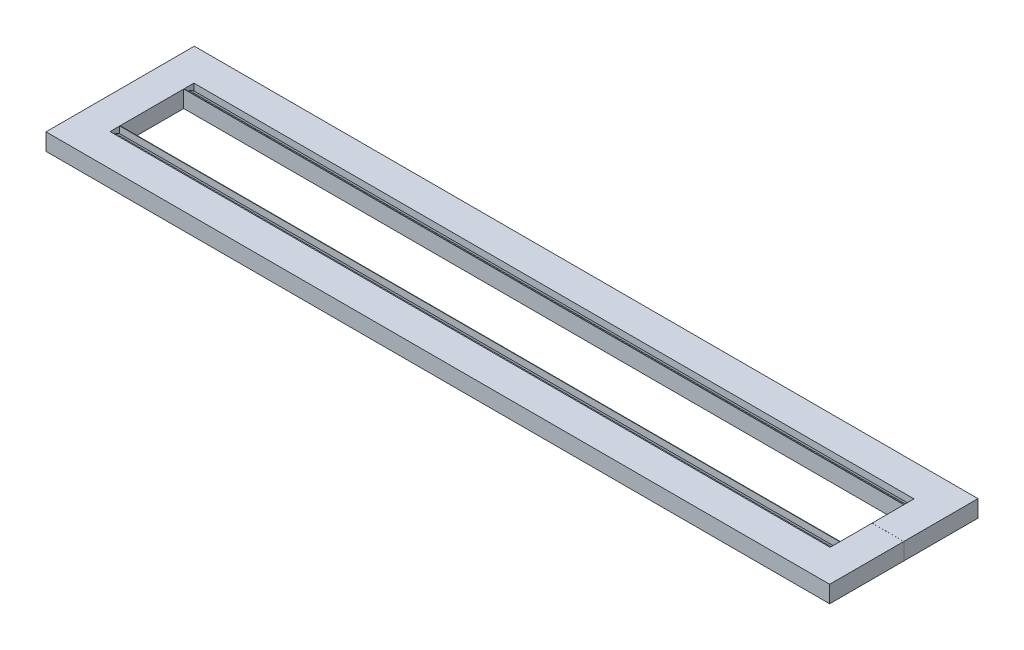
ISO-10303-21;
HEADER;
FILE_DESCRIPTION(('STEP AP214'),'2;1');
FILE_NAME('part.step','',(''),(''),'','','');
FILE_SCHEMA(('AUTOMOTIVE_DESIGN { 1 0 10303 214 1 1 1 1 }'));
ENDSEC;
DATA;
#1=APPLICATION_CONTEXT('core data for automotive mechanical design processes');
#2=APPLICATION_PROTOCOL_DEFINITION('international standard','automotive_design',2000,#1);
#3=PRODUCT_CONTEXT('',#1,'mechanical');
#4=PRODUCT('Part','Part','',(#3));
#5=PRODUCT_RELATED_PRODUCT_CATEGORY('part','',(#4));
#6=PRODUCT_DEFINITION_FORMATION('','',#4);
#7=PRODUCT_DEFINITION_CONTEXT('part definition',#1,'design');
#8=PRODUCT_DEFINITION('design','',#6,#7);
#9=PRODUCT_DEFINITION_SHAPE('','',#8);
#10=(LENGTH_UNIT() NAMED_UNIT(*) SI_UNIT(.MILLI.,.METRE.));
#11=(NAMED_UNIT(*) PLANE_ANGLE_UNIT() SI_UNIT($,.RADIAN.));
#12=(NAMED_UNIT(*) SI_UNIT($,.STERADIAN.) SOLID_ANGLE_UNIT());
#13=UNCERTAINTY_MEASURE_WITH_UNIT(LENGTH_MEASURE(1.E-05),#10,'distance_accuracy_value','');
#14=(GEOMETRIC_REPRESENTATION_CONTEXT(3) GLOBAL_UNCERTAINTY_ASSIGNED_CONTEXT((#13)) GLOBAL_UNIT_ASSIGNED_CONTEXT((#10,
#11,#12)) REPRESENTATION_CONTEXT('',''));
#15=CARTESIAN_POINT('',(0.,0.,0.));
#16=DIRECTION('',(0.,0.,1.));
#17=DIRECTION('',(1.,0.,0.));
#18=AXIS2_PLACEMENT_3D('',#15,#16,#17);
#19=CARTESIAN_POINT('',(0.,0.,0.));
#20=DIRECTION('',(0.,1.,0.));
#21=DIRECTION('',(0.,0.,1.));
#22=AXIS2_PLACEMENT_3D('',#19,#20,#21);
#23=PLANE('',#22);
#24=CARTESIAN_POINT('',(25.4039073980687,0.,-36.2480453043841));
#25=DIRECTION('',(0.,-1.,0.));
#26=DIRECTION('',(0.,0.,-1.));
#27=AXIS2_PLACEMENT_3D('',#24,#25,#26);
#28=CIRCLE('',#27,5.79119999999999);
#29=CARTESIAN_POINT('',(25.4039073980687,0.,-42.0392453043841));
#30=VERTEX_POINT('',#29);
#31=EDGE_CURVE('E593',#30,#30,#28,.T.);
#32=ORIENTED_EDGE('',*,*,#31,.F.);
#33=EDGE_LOOP('',(#32));
#34=FACE_BOUND('',#33,.T.);
#35=CARTESIAN_POINT('',(-425.156251148069,0.,10.2267903256609));
#36=DIRECTION('',(0.,-1.,0.));
#37=DIRECTION('',(0.,0.,-1.));
#38=AXIS2_PLACEMENT_3D('',#35,#36,#37);
#39=CIRCLE('',#38,5.79119999999999);
#40=CARTESIAN_POINT('',(-425.156251148069,0.,4.43559032566088));
#41=VERTEX_POINT('',#40);
#42=EDGE_CURVE('E604',#41,#41,#39,.T.);
#43=ORIENTED_EDGE('',*,*,#42,.F.);
#44=EDGE_LOOP('',(#43));
#45=FACE_BOUND('',#44,.T.);
#46=DIRECTION('',(-1.,0.,0.));
#47=VECTOR('',#46,1.);
#48=CARTESIAN_POINT('',(0.,0.,-32.0724609375));
#49=LINE('',#48,#47);
#50=CARTESIAN_POINT('',(16.0380255436917,0.,-32.0724609375));
#51=VERTEX_POINT('',#50);
#52=CARTESIAN_POINT('',(-415.776171875,0.,-32.0724609375));
#53=VERTEX_POINT('',#52);
#54=EDGE_CURVE('E347',#51,#53,#49,.T.);
#55=ORIENTED_EDGE('',*,*,#54,.T.);
#56=DIRECTION('',(0.,0.,1.));
#57=VECTOR('',#56,1.);
#58=CARTESIAN_POINT('',(-415.776171875,0.,-57.4724609374997));
#59=LINE('',#58,#57);
#60=CARTESIAN_POINT('',(-415.776171875,0.,6.074872855054));
#61=VERTEX_POINT('',#60);
#62=EDGE_CURVE('E301',#53,#61,#59,.T.);
#63=ORIENTED_EDGE('',*,*,#62,.T.);
#64=DIRECTION('',(-1.,0.,0.));
#65=VECTOR('',#64,1.);
#66=CARTESIAN_POINT('',(0.,0.,6.07487285505302));
#67=LINE('',#66,#65);
#68=CARTESIAN_POINT('',(16.0380255436917,0.,6.07487285505298));
#69=VERTEX_POINT('',#68);
#70=EDGE_CURVE('E269',#69,#61,#67,.T.);
#71=ORIENTED_EDGE('',*,*,#70,.F.);
#72=DIRECTION('',(0.,0.,1.));
#73=VECTOR('',#72,1.);
#74=CARTESIAN_POINT('',(16.0380255436917,0.,-25.997588082447));
#75=LINE('',#74,#73);
#76=CARTESIAN_POINT('',(16.0380255436917,0.,-12.975127144947));
#77=VERTEX_POINT('',#76);
#78=EDGE_CURVE('E272',#77,#69,#75,.T.);
#79=ORIENTED_EDGE('',*,*,#78,.F.);
#80=DIRECTION('',(1.,0.,0.));
#81=VECTOR('',#80,1.);
#82=CARTESIAN_POINT('',(0.,0.,-12.975127144947));
#83=LINE('',#82,#81);
#84=CARTESIAN_POINT('',(35.073828125,0.,-12.9751271449471));
#85=VERTEX_POINT('',#84);
#86=EDGE_CURVE('E275',#77,#85,#83,.T.);
#87=ORIENTED_EDGE('',*,*,#86,.T.);
#88=DIRECTION('',(0.,0.,-1.));
#89=VECTOR('',#88,1.);
#90=CARTESIAN_POINT('',(35.0738281249999,0.,-25.9975880824471));
#91=LINE('',#90,#89);
#92=CARTESIAN_POINT('',(35.0738281250001,0.,31.4748728550529));
#93=VERTEX_POINT('',#92);
#94=EDGE_CURVE('E277',#93,#85,#91,.T.);
#95=ORIENTED_EDGE('',*,*,#94,.F.);
#96=DIRECTION('',(1.,0.,0.));
#97=VECTOR('',#96,1.);
#98=CARTESIAN_POINT('',(0.,0.,31.474872855053));
#99=LINE('',#98,#97);
#100=CARTESIAN_POINT('',(-434.826171875,0.,31.4748728550538));
#101=VERTEX_POINT('',#100);
#102=EDGE_CURVE('E258',#101,#93,#99,.T.);
#103=ORIENTED_EDGE('',*,*,#102,.F.);
#104=DIRECTION('',(0.,0.,1.));
#105=VECTOR('',#104,1.);
#106=CARTESIAN_POINT('',(-434.826171875,0.,5.43030402390597E-13));
#107=LINE('',#106,#105);
#108=CARTESIAN_POINT('',(-434.826171875,0.,-57.4724609374997));
#109=VERTEX_POINT('',#108);
#110=EDGE_CURVE('E357',#109,#101,#107,.T.);
#111=ORIENTED_EDGE('',*,*,#110,.F.);
#112=DIRECTION('',(1.,0.,0.));
#113=VECTOR('',#112,1.);
#114=CARTESIAN_POINT('',(0.,0.,-57.4724609375));
#115=LINE('',#114,#113);
#116=CARTESIAN_POINT('',(35.073828125,0.,-57.4724609375));
#117=VERTEX_POINT('',#116);
#118=EDGE_CURVE('E379',#109,#117,#115,.T.);
#119=ORIENTED_EDGE('',*,*,#118,.T.);
#120=DIRECTION('',(0.,0.,1.));
#121=VECTOR('',#120,1.);
#122=CARTESIAN_POINT('',(35.073828125,0.,0.));
#123=LINE('',#122,#121);
#124=CARTESIAN_POINT('',(35.073828125,0.,-13.0224609375));
#125=VERTEX_POINT('',#124);
#126=EDGE_CURVE('E376',#117,#125,#123,.T.);
#127=ORIENTED_EDGE('',*,*,#126,.T.);
#128=DIRECTION('',(1.,0.,0.));
#129=VECTOR('',#128,1.);
#130=CARTESIAN_POINT('',(0.,0.,-13.0224609375));
#131=LINE('',#130,#129);
#132=CARTESIAN_POINT('',(16.0380255436917,0.,-13.0224609375));
#133=VERTEX_POINT('',#132);
#134=EDGE_CURVE('E373',#133,#125,#131,.T.);
#135=ORIENTED_EDGE('',*,*,#134,.F.);
#136=DIRECTION('',(0.,0.,-1.));
#137=VECTOR('',#136,1.);
#138=CARTESIAN_POINT('',(16.0380255436917,0.,0.));
#139=LINE('',#138,#137);
#140=EDGE_CURVE('E370',#133,#51,#139,.T.);
#141=ORIENTED_EDGE('',*,*,#140,.T.);
#142=EDGE_LOOP('',(#55,#63,#71,#79,#87,#95,#103,#111,#119,#127,#135,#141));
#143=FACE_BOUND('',#142,.T.);
#144=CARTESIAN_POINT('',(25.4039073980687,0.,10.2267903256609));
#145=DIRECTION('',(0.,-1.,0.));
#146=DIRECTION('',(0.,0.,-1.));
#147=AXIS2_PLACEMENT_3D('',#144,#145,#146);
#148=CIRCLE('',#147,5.79119999999999);
#149=CARTESIAN_POINT('',(25.4039073980687,0.,4.43559032566088));
#150=VERTEX_POINT('',#149);
#151=EDGE_CURVE('E589',#150,#150,#148,.F.);
#152=ORIENTED_EDGE('',*,*,#151,.T.);
#153=EDGE_LOOP('',(#152));
#154=FACE_BOUND('',#153,.T.);
#155=CARTESIAN_POINT('',(-425.156251148069,0.,-36.2480453043841));
#156=DIRECTION('',(0.,1.,0.));
#157=DIRECTION('',(0.,0.,1.));
#158=AXIS2_PLACEMENT_3D('',#155,#156,#157);
#159=CIRCLE('',#158,5.79119999999999);
#160=CARTESIAN_POINT('',(-425.156251148069,0.,-30.4568453043841));
#161=VERTEX_POINT('',#160);
#162=EDGE_CURVE('E595',#161,#161,#159,.T.);
#163=ORIENTED_EDGE('',*,*,#162,.T.);
#164=EDGE_LOOP('',(#163));
#165=FACE_BOUND('',#164,.T.);
#166=ADVANCED_FACE('F35',(#34,#45,#143,#154,#165),#23,.F.);
#167=CARTESIAN_POINT('',(35.073828125,10.16,0.));
#168=DIRECTION('',(1.,0.,0.));
#169=DIRECTION('',(0.,0.,-1.));
#170=AXIS2_PLACEMENT_3D('',#167,#168,#169);
#171=PLANE('',#170);
#172=DIRECTION('',(0.,0.,1.));
#173=VECTOR('',#172,1.);
#174=CARTESIAN_POINT('',(35.073828125,10.16,0.));
#175=LINE('',#174,#173);
#176=CARTESIAN_POINT('',(35.073828125,10.16,-57.4724609375));
#177=VERTEX_POINT('',#176);
#178=CARTESIAN_POINT('',(35.073828125,10.16,-13.0224609375));
#179=VERTEX_POINT('',#178);
#180=EDGE_CURVE('E362',#177,#179,#175,.T.);
#181=ORIENTED_EDGE('',*,*,#180,.T.);
#182=DIRECTION('',(0.,-1.,0.));
#183=VECTOR('',#182,1.);
#184=CARTESIAN_POINT('',(35.073828125,10.16,-13.0224609375));
#185=LINE('',#184,#183);
#186=EDGE_CURVE('E386',#179,#125,#185,.T.);
#187=ORIENTED_EDGE('',*,*,#186,.T.);
#188=ORIENTED_EDGE('',*,*,#126,.F.);
#189=DIRECTION('',(0.,-1.,0.));
#190=VECTOR('',#189,1.);
#191=CARTESIAN_POINT('',(35.073828125,10.16,-57.4724609375));
#192=LINE('',#191,#190);
#193=EDGE_CURVE('E383',#177,#117,#192,.T.);
#194=ORIENTED_EDGE('',*,*,#193,.F.);
#195=EDGE_LOOP('',(#181,#187,#188,#194));
#196=FACE_BOUND('',#195,.T.);
#197=ADVANCED_FACE('F454',(#196),#171,.T.);
#198=CARTESIAN_POINT('',(-434.826171875,10.16,5.43030402390597E-13));
#199=DIRECTION('',(1.,0.,0.));
#200=DIRECTION('',(0.,0.,-1.));
#201=AXIS2_PLACEMENT_3D('',#198,#199,#200);
#202=PLANE('',#201);
#203=ORIENTED_EDGE('',*,*,#110,.T.);
#204=DIRECTION('',(0.,-1.,0.));
#205=VECTOR('',#204,1.);
#206=CARTESIAN_POINT('',(-434.826171875,10.16,31.4748728550538));
#207=LINE('',#206,#205);
#208=CARTESIAN_POINT('',(-434.826171875,10.16,31.4748728550538));
#209=VERTEX_POINT('',#208);
#210=EDGE_CURVE('E268',#209,#101,#207,.T.);
#211=ORIENTED_EDGE('',*,*,#210,.F.);
#212=DIRECTION('',(0.,0.,1.));
#213=VECTOR('',#212,1.);
#214=CARTESIAN_POINT('',(-434.826171875,10.16,5.43030402390597E-13));
#215=LINE('',#214,#213);
#216=CARTESIAN_POINT('',(-434.826171875,10.16,-57.4724609374997));
#217=VERTEX_POINT('',#216);
#218=EDGE_CURVE('E366',#217,#209,#215,.T.);
#219=ORIENTED_EDGE('',*,*,#218,.F.);
#220=DIRECTION('',(0.,-1.,0.));
#221=VECTOR('',#220,1.);
#222=CARTESIAN_POINT('',(-434.826171875,10.16,-57.4724609374997));
#223=LINE('',#222,#221);
#224=EDGE_CURVE('E368',#217,#109,#223,.T.);
#225=ORIENTED_EDGE('',*,*,#224,.T.);
#226=EDGE_LOOP('',(#203,#211,#219,#225));
#227=FACE_BOUND('',#226,.T.);
#228=ADVANCED_FACE('F463',(#227),#202,.F.);
#229=CARTESIAN_POINT('',(0.,10.16,-32.0724609375));
#230=DIRECTION('',(0.,0.,1.));
#231=DIRECTION('',(1.,0.,0.));
#232=AXIS2_PLACEMENT_3D('',#229,#230,#231);
#233=PLANE('',#232);
#234=DIRECTION('',(0.,1.,0.));
#235=VECTOR('',#234,1.);
#236=CARTESIAN_POINT('',(-415.776171875,10.16,-32.0724609375));
#237=LINE('',#236,#235);
#238=CARTESIAN_POINT('',(-415.776171875,10.16,-32.0724609375));
#239=VERTEX_POINT('',#238);
#240=EDGE_CURVE('E54',#53,#239,#237,.T.);
#241=ORIENTED_EDGE('',*,*,#240,.F.);
#242=ORIENTED_EDGE('',*,*,#54,.F.);
#243=DIRECTION('',(0.,-1.,0.));
#244=VECTOR('',#243,1.);
#245=CARTESIAN_POINT('',(16.0380255436917,10.16,-32.0724609375));
#246=LINE('',#245,#244);
#247=CARTESIAN_POINT('',(16.0380255436917,4.46791413554748,-32.0724609375));
#248=VERTEX_POINT('',#247);
#249=EDGE_CURVE('E390',#248,#51,#246,.T.);
#250=ORIENTED_EDGE('',*,*,#249,.F.);
#251=DIRECTION('',(1.,0.,0.));
#252=VECTOR('',#251,1.);
#253=CARTESIAN_POINT('',(0.,4.46791413554748,-32.0724609375));
#254=LINE('',#253,#252);
#255=CARTESIAN_POINT('',(16.023828125,4.46791413554748,-32.0724609375));
#256=VERTEX_POINT('',#255);
#257=EDGE_CURVE('E341',#256,#248,#254,.T.);
#258=ORIENTED_EDGE('',*,*,#257,.F.);
#259=DIRECTION('',(0.,-1.,0.));
#260=VECTOR('',#259,1.);
#261=CARTESIAN_POINT('',(16.023828125,10.16,-32.0724609375));
#262=LINE('',#261,#260);
#263=CARTESIAN_POINT('',(16.023828125,10.16,-32.0724609375));
#264=VERTEX_POINT('',#263);
#265=EDGE_CURVE('E335',#264,#256,#262,.T.);
#266=ORIENTED_EDGE('',*,*,#265,.F.);
#267=DIRECTION('',(-1.,0.,0.));
#268=VECTOR('',#267,1.);
#269=CARTESIAN_POINT('',(0.,10.16,-32.0724609375));
#270=LINE('',#269,#268);
#271=EDGE_CURVE('E50',#264,#239,#270,.T.);
#272=ORIENTED_EDGE('',*,*,#271,.T.);
#273=EDGE_LOOP('',(#241,#242,#250,#258,#266,#272));
#274=FACE_BOUND('',#273,.T.);
#275=ADVANCED_FACE('F37',(#274),#233,.T.);
#276=CARTESIAN_POINT('',(16.0380255436917,10.16,0.));
#277=DIRECTION('',(-1.,0.,0.));
#278=DIRECTION('',(0.,0.,1.));
#279=AXIS2_PLACEMENT_3D('',#276,#277,#278);
#280=PLANE('',#279);
#281=DIRECTION('',(0.,0.,1.));
#282=VECTOR('',#281,1.);
#283=CARTESIAN_POINT('',(16.0380255436917,4.46791413554748,0.));
#284=LINE('',#283,#282);
#285=CARTESIAN_POINT('',(16.0380255436917,4.46791413554748,-28.3559374726998));
#286=VERTEX_POINT('',#285);
#287=EDGE_CURVE('E43',#248,#286,#284,.T.);
#288=ORIENTED_EDGE('',*,*,#287,.F.);
#289=ORIENTED_EDGE('',*,*,#249,.T.);
#290=ORIENTED_EDGE('',*,*,#140,.F.);
#291=DIRECTION('',(0.,-1.,0.));
#292=VECTOR('',#291,1.);
#293=CARTESIAN_POINT('',(16.0380255436917,10.16,-13.0224609375));
#294=LINE('',#293,#292);
#295=CARTESIAN_POINT('',(16.0380255436917,10.16,-13.0224609375));
#296=VERTEX_POINT('',#295);
#297=EDGE_CURVE('E388',#296,#133,#294,.T.);
#298=ORIENTED_EDGE('',*,*,#297,.F.);
#299=DIRECTION('',(0.,0.,-1.));
#300=VECTOR('',#299,1.);
#301=CARTESIAN_POINT('',(16.0380255436917,10.16,0.));
#302=LINE('',#301,#300);
#303=CARTESIAN_POINT('',(16.0380255436917,10.16,-28.3559374726998));
#304=VERTEX_POINT('',#303);
#305=EDGE_CURVE('E356',#296,#304,#302,.T.);
#306=ORIENTED_EDGE('',*,*,#305,.T.);
#307=DIRECTION('',(0.,1.,0.));
#308=VECTOR('',#307,1.);
#309=CARTESIAN_POINT('',(16.0380255436917,10.16,-28.3559374726998));
#310=LINE('',#309,#308);
#311=EDGE_CURVE('E338',#286,#304,#310,.T.);
#312=ORIENTED_EDGE('',*,*,#311,.F.);
#313=EDGE_LOOP('',(#288,#289,#290,#298,#306,#312));
#314=FACE_BOUND('',#313,.T.);
#315=ADVANCED_FACE('F459',(#314),#280,.T.);
#316=CARTESIAN_POINT('',(0.,10.16,-13.0224609375));
#317=DIRECTION('',(0.,0.,-1.));
#318=DIRECTION('',(-1.,0.,0.));
#319=AXIS2_PLACEMENT_3D('',#316,#317,#318);
#320=PLANE('',#319);
#321=ORIENTED_EDGE('',*,*,#134,.T.);
#322=ORIENTED_EDGE('',*,*,#186,.F.);
#323=DIRECTION('',(1.,0.,0.));
#324=VECTOR('',#323,1.);
#325=CARTESIAN_POINT('',(0.,10.16,-13.0224609375));
#326=LINE('',#325,#324);
#327=EDGE_CURVE('E359',#296,#179,#326,.T.);
#328=ORIENTED_EDGE('',*,*,#327,.F.);
#329=ORIENTED_EDGE('',*,*,#297,.T.);
#330=EDGE_LOOP('',(#321,#322,#328,#329));
#331=FACE_BOUND('',#330,.T.);
#332=ADVANCED_FACE('F462',(#331),#320,.F.);
#333=CARTESIAN_POINT('',(0.,10.16,-57.4724609375));
#334=DIRECTION('',(0.,0.,-1.));
#335=DIRECTION('',(-1.,0.,0.));
#336=AXIS2_PLACEMENT_3D('',#333,#334,#335);
#337=PLANE('',#336);
#338=ORIENTED_EDGE('',*,*,#193,.T.);
#339=ORIENTED_EDGE('',*,*,#118,.F.);
#340=ORIENTED_EDGE('',*,*,#224,.F.);
#341=DIRECTION('',(1.,0.,0.));
#342=VECTOR('',#341,1.);
#343=CARTESIAN_POINT('',(0.,10.16,-57.4724609375));
#344=LINE('',#343,#342);
#345=EDGE_CURVE('E364',#217,#177,#344,.T.);
#346=ORIENTED_EDGE('',*,*,#345,.T.);
#347=EDGE_LOOP('',(#338,#339,#340,#346));
#348=FACE_BOUND('',#347,.T.);
#349=ADVANCED_FACE('F447',(#348),#337,.T.);
#350=CARTESIAN_POINT('',(0.,10.16,0.));
#351=DIRECTION('',(0.,1.,0.));
#352=DIRECTION('',(0.,0.,1.));
#353=AXIS2_PLACEMENT_3D('',#350,#351,#352);
#354=PLANE('',#353);
#355=DIRECTION('',(1.,0.,0.));
#356=VECTOR('',#355,1.);
#357=CARTESIAN_POINT('',(-434.826171875,10.16,-32.3389235501477));
#358=LINE('',#357,#356);
#359=CARTESIAN_POINT('',(-415.776171875,10.16,-32.3389235501477));
#360=VERTEX_POINT('',#359);
#361=CARTESIAN_POINT('',(16.023828125,10.16,-32.3389235501477));
#362=VERTEX_POINT('',#361);
#363=EDGE_CURVE('E352',#360,#362,#358,.T.);
#364=ORIENTED_EDGE('',*,*,#363,.F.);
#365=DIRECTION('',(0.,0.,-1.));
#366=VECTOR('',#365,1.);
#367=CARTESIAN_POINT('',(-415.776171875,10.16,-57.4724609374997));
#368=LINE('',#367,#366);
#369=CARTESIAN_POINT('',(-415.776171875,10.16,-38.1559983248523));
#370=VERTEX_POINT('',#369);
#371=EDGE_CURVE('E231',#360,#370,#368,.T.);
#372=ORIENTED_EDGE('',*,*,#371,.T.);
#373=DIRECTION('',(1.,0.,0.));
#374=VECTOR('',#373,1.);
#375=CARTESIAN_POINT('',(-434.826171875,10.16,-38.1559983248523));
#376=LINE('',#375,#374);
#377=CARTESIAN_POINT('',(16.023828125,10.16,-38.1559983248523));
#378=VERTEX_POINT('',#377);
#379=EDGE_CURVE('E344',#370,#378,#376,.T.);
#380=ORIENTED_EDGE('',*,*,#379,.T.);
#381=DIRECTION('',(0.,0.,1.));
#382=VECTOR('',#381,1.);
#383=CARTESIAN_POINT('',(16.023828125,10.16,-28.3559374726998));
#384=LINE('',#383,#382);
#385=EDGE_CURVE('E313',#378,#362,#384,.T.);
#386=ORIENTED_EDGE('',*,*,#385,.T.);
#387=EDGE_LOOP('',(#364,#372,#380,#386));
#388=FACE_BOUND('',#387,.T.);
#389=CARTESIAN_POINT('',(-415.776171875,10.16,6.074872855054));
#390=VERTEX_POINT('',#389);
#391=EDGE_CURVE('E298',#390,#239,#368,.T.);
#392=ORIENTED_EDGE('',*,*,#391,.T.);
#393=ORIENTED_EDGE('',*,*,#271,.F.);
#394=CARTESIAN_POINT('',(16.023828125,10.16,-28.3559374726998));
#395=VERTEX_POINT('',#394);
#396=EDGE_CURVE('E311',#264,#395,#384,.T.);
#397=ORIENTED_EDGE('',*,*,#396,.T.);
#398=DIRECTION('',(1.,0.,0.));
#399=VECTOR('',#398,1.);
#400=CARTESIAN_POINT('',(16.023828125,10.16,-28.3559374726998));
#401=LINE('',#400,#399);
#402=EDGE_CURVE('E320',#395,#304,#401,.T.);
#403=ORIENTED_EDGE('',*,*,#402,.T.);
#404=ORIENTED_EDGE('',*,*,#305,.F.);
#405=ORIENTED_EDGE('',*,*,#327,.T.);
#406=ORIENTED_EDGE('',*,*,#180,.F.);
#407=ORIENTED_EDGE('',*,*,#345,.F.);
#408=ORIENTED_EDGE('',*,*,#218,.T.);
#409=DIRECTION('',(1.,0.,0.));
#410=VECTOR('',#409,1.);
#411=CARTESIAN_POINT('',(0.,10.16,31.474872855053));
#412=LINE('',#411,#410);
#413=CARTESIAN_POINT('',(35.0738281250001,10.16,31.4748728550529));
#414=VERTEX_POINT('',#413);
#415=EDGE_CURVE('E266',#209,#414,#412,.T.);
#416=ORIENTED_EDGE('',*,*,#415,.T.);
#417=DIRECTION('',(0.,0.,-1.));
#418=VECTOR('',#417,1.);
#419=CARTESIAN_POINT('',(35.0738281249999,10.16,-25.9975880824471));
#420=LINE('',#419,#418);
#421=CARTESIAN_POINT('',(35.073828125,10.16,-12.9751271449471));
#422=VERTEX_POINT('',#421);
#423=EDGE_CURVE('E263',#414,#422,#420,.T.);
#424=ORIENTED_EDGE('',*,*,#423,.T.);
#425=DIRECTION('',(1.,0.,0.));
#426=VECTOR('',#425,1.);
#427=CARTESIAN_POINT('',(0.,10.16,-12.975127144947));
#428=LINE('',#427,#426);
#429=CARTESIAN_POINT('',(16.0380255436917,10.16,-12.975127144947));
#430=VERTEX_POINT('',#429);
#431=EDGE_CURVE('E261',#430,#422,#428,.T.);
#432=ORIENTED_EDGE('',*,*,#431,.F.);
#433=DIRECTION('',(0.,0.,1.));
#434=VECTOR('',#433,1.);
#435=CARTESIAN_POINT('',(16.0380255436917,10.16,-25.997588082447));
#436=LINE('',#435,#434);
#437=CARTESIAN_POINT('',(16.0380255436917,10.16,2.35834939025277));
#438=VERTEX_POINT('',#437);
#439=EDGE_CURVE('E257',#430,#438,#436,.T.);
#440=ORIENTED_EDGE('',*,*,#439,.T.);
#441=DIRECTION('',(1.,0.,0.));
#442=VECTOR('',#441,1.);
#443=CARTESIAN_POINT('',(16.023828125,10.16,2.35834939025277));
#444=LINE('',#443,#442);
#445=CARTESIAN_POINT('',(16.023828125,10.16,2.35834939025277));
#446=VERTEX_POINT('',#445);
#447=EDGE_CURVE('E625',#446,#438,#444,.T.);
#448=ORIENTED_EDGE('',*,*,#447,.F.);
#449=DIRECTION('',(0.,0.,-1.));
#450=VECTOR('',#449,1.);
#451=CARTESIAN_POINT('',(16.023828125,10.16,2.35834939025277));
#452=LINE('',#451,#450);
#453=CARTESIAN_POINT('',(16.023828125,10.16,6.07487285505298));
#454=VERTEX_POINT('',#453);
#455=EDGE_CURVE('E616',#454,#446,#452,.T.);
#456=ORIENTED_EDGE('',*,*,#455,.F.);
#457=DIRECTION('',(-1.,0.,0.));
#458=VECTOR('',#457,1.);
#459=CARTESIAN_POINT('',(0.,10.16,6.07487285505302));
#460=LINE('',#459,#458);
#461=EDGE_CURVE('E254',#454,#390,#460,.T.);
#462=ORIENTED_EDGE('',*,*,#461,.T.);
#463=EDGE_LOOP('',(#392,#393,#397,#403,#404,#405,#406,#407,#408,#416,#424,#432,#440,#448,#456,#462));
#464=FACE_BOUND('',#463,.T.);
#465=DIRECTION('',(1.,0.,0.));
#466=VECTOR('',#465,1.);
#467=CARTESIAN_POINT('',(-434.826171875,10.16,6.34133546770175));
#468=LINE('',#467,#466);
#469=CARTESIAN_POINT('',(-415.776171875,10.16,6.3413354677017));
#470=VERTEX_POINT('',#469);
#471=CARTESIAN_POINT('',(16.023828125,10.16,6.34133546770062));
#472=VERTEX_POINT('',#471);
#473=EDGE_CURVE('E238',#470,#472,#468,.T.);
#474=ORIENTED_EDGE('',*,*,#473,.T.);
#475=CARTESIAN_POINT('',(16.023828125,10.16,12.1584102424053));
#476=VERTEX_POINT('',#475);
#477=EDGE_CURVE('E619',#476,#472,#452,.T.);
#478=ORIENTED_EDGE('',*,*,#477,.F.);
#479=DIRECTION('',(1.,0.,0.));
#480=VECTOR('',#479,1.);
#481=CARTESIAN_POINT('',(-434.826171875,10.16,12.1584102424064));
#482=LINE('',#481,#480);
#483=CARTESIAN_POINT('',(-415.776171875,10.16,12.1584102424064));
#484=VERTEX_POINT('',#483);
#485=EDGE_CURVE('E240',#484,#476,#482,.T.);
#486=ORIENTED_EDGE('',*,*,#485,.F.);
#487=DIRECTION('',(0.,0.,1.));
#488=VECTOR('',#487,1.);
#489=CARTESIAN_POINT('',(-415.776171875,10.16,31.4748728550538));
#490=LINE('',#489,#488);
#491=EDGE_CURVE('E224',#470,#484,#490,.T.);
#492=ORIENTED_EDGE('',*,*,#491,.F.);
#493=EDGE_LOOP('',(#474,#478,#486,#492));
#494=FACE_BOUND('',#493,.T.);
#495=ADVANCED_FACE('F236',(#388,#464,#494),#354,.T.);
#496=CARTESIAN_POINT('',(-434.826171875,0.,-38.1559983248523));
#497=DIRECTION('',(0.,0.,1.));
#498=DIRECTION('',(1.,0.,0.));
#499=AXIS2_PLACEMENT_3D('',#496,#497,#498);
#500=PLANE('',#499);
#501=DIRECTION('',(0.,1.,0.));
#502=VECTOR('',#501,1.);
#503=CARTESIAN_POINT('',(-415.776171875,0.,-38.1559983248523));
#504=LINE('',#503,#502);
#505=CARTESIAN_POINT('',(-415.776171875,6.15269331412021,-38.1559983248523));
#506=VERTEX_POINT('',#505);
#507=EDGE_CURVE('E308',#506,#370,#504,.T.);
#508=ORIENTED_EDGE('',*,*,#507,.F.);
#509=DIRECTION('',(1.,0.,0.));
#510=VECTOR('',#509,1.);
#511=CARTESIAN_POINT('',(-434.826171875,6.15269331412022,-38.1559983248523));
#512=LINE('',#511,#510);
#513=CARTESIAN_POINT('',(16.023828125,6.15269331412022,-38.1559983248523));
#514=VERTEX_POINT('',#513);
#515=EDGE_CURVE('E345',#506,#514,#512,.T.);
#516=ORIENTED_EDGE('',*,*,#515,.T.);
#517=DIRECTION('',(0.,-1.,0.));
#518=VECTOR('',#517,1.);
#519=CARTESIAN_POINT('',(16.023828125,0.,-38.1559983248523));
#520=LINE('',#519,#518);
#521=EDGE_CURVE('E332',#378,#514,#520,.T.);
#522=ORIENTED_EDGE('',*,*,#521,.F.);
#523=ORIENTED_EDGE('',*,*,#379,.F.);
#524=EDGE_LOOP('',(#508,#516,#522,#523));
#525=FACE_BOUND('',#524,.T.);
#526=ADVANCED_FACE('F482',(#525),#500,.T.);
#527=CARTESIAN_POINT('',(-434.826171875,21.1365519136295,-12.2031939370745));
#528=DIRECTION('',(0.,-0.866025403784438,0.5));
#529=DIRECTION('',(0.,-0.5,-0.866025403784438));
#530=AXIS2_PLACEMENT_3D('',#527,#528,#529);
#531=PLANE('',#530);
#532=ORIENTED_EDGE('',*,*,#515,.F.);
#533=DIRECTION('',(0.,0.5,0.866025403784438));
#534=VECTOR('',#533,1.);
#535=CARTESIAN_POINT('',(-415.776171875,21.1365519136295,-12.2031939370745));
#536=LINE('',#535,#534);
#537=CARTESIAN_POINT('',(-415.776171875,7.83193815765617,-35.2474609375));
#538=VERTEX_POINT('',#537);
#539=EDGE_CURVE('E305',#506,#538,#536,.T.);
#540=ORIENTED_EDGE('',*,*,#539,.T.);
#541=DIRECTION('',(1.,0.,0.));
#542=VECTOR('',#541,1.);
#543=CARTESIAN_POINT('',(-434.826171875,7.83193815765617,-35.2474609375));
#544=LINE('',#543,#542);
#545=CARTESIAN_POINT('',(16.023828125,7.83193815765617,-35.2474609375));
#546=VERTEX_POINT('',#545);
#547=EDGE_CURVE('E348',#538,#546,#544,.T.);
#548=ORIENTED_EDGE('',*,*,#547,.T.);
#549=DIRECTION('',(0.,-0.5,-0.866025403784438));
#550=VECTOR('',#549,1.);
#551=CARTESIAN_POINT('',(16.023828125,21.1365519136295,-12.2031939370745));
#552=LINE('',#551,#550);
#553=EDGE_CURVE('E329',#546,#514,#552,.T.);
#554=ORIENTED_EDGE('',*,*,#553,.T.);
#555=EDGE_LOOP('',(#532,#540,#548,#554));
#556=FACE_BOUND('',#555,.T.);
#557=ADVANCED_FACE('F486',(#556),#531,.F.);
#558=CARTESIAN_POINT('',(-434.826171875,-9.38864467714522,-5.42053653167555));
#559=DIRECTION('',(0.,0.866025403784438,0.5));
#560=DIRECTION('',(0.,-0.5,0.866025403784438));
#561=AXIS2_PLACEMENT_3D('',#558,#559,#560);
#562=PLANE('',#561);
#563=DIRECTION('',(0.,0.5,-0.866025403784438));
#564=VECTOR('',#563,1.);
#565=CARTESIAN_POINT('',(-415.776171875,-9.38864467714521,-5.42053653167556));
#566=LINE('',#565,#564);
#567=CARTESIAN_POINT('',(-415.776171875,6.15269331412021,-32.3389235501477));
#568=VERTEX_POINT('',#567);
#569=EDGE_CURVE('E303',#568,#538,#566,.T.);
#570=ORIENTED_EDGE('',*,*,#569,.F.);
#571=DIRECTION('',(1.,0.,0.));
#572=VECTOR('',#571,1.);
#573=CARTESIAN_POINT('',(-434.826171875,6.15269331412021,-32.3389235501477));
#574=LINE('',#573,#572);
#575=CARTESIAN_POINT('',(16.023828125,6.15269331412021,-32.3389235501477));
#576=VERTEX_POINT('',#575);
#577=EDGE_CURVE('E350',#568,#576,#574,.T.);
#578=ORIENTED_EDGE('',*,*,#577,.T.);
#579=DIRECTION('',(0.,-0.5,0.866025403784438));
#580=VECTOR('',#579,1.);
#581=CARTESIAN_POINT('',(16.023828125,-9.38864467714522,-5.42053653167555));
#582=LINE('',#581,#580);
#583=EDGE_CURVE('E324',#546,#576,#582,.T.);
#584=ORIENTED_EDGE('',*,*,#583,.F.);
#585=ORIENTED_EDGE('',*,*,#547,.F.);
#586=EDGE_LOOP('',(#570,#578,#584,#585));
#587=FACE_BOUND('',#586,.T.);
#588=ADVANCED_FACE('F492',(#587),#562,.T.);
#589=CARTESIAN_POINT('',(-434.826171875,0.,-32.3389235501477));
#590=DIRECTION('',(0.,0.,1.));
#591=DIRECTION('',(1.,0.,0.));
#592=AXIS2_PLACEMENT_3D('',#589,#590,#591);
#593=PLANE('',#592);
#594=ORIENTED_EDGE('',*,*,#577,.F.);
#595=DIRECTION('',(0.,1.,0.));
#596=VECTOR('',#595,1.);
#597=CARTESIAN_POINT('',(-415.776171875,0.,-32.3389235501477));
#598=LINE('',#597,#596);
#599=EDGE_CURVE('E11',#568,#360,#598,.T.);
#600=ORIENTED_EDGE('',*,*,#599,.T.);
#601=ORIENTED_EDGE('',*,*,#363,.T.);
#602=DIRECTION('',(0.,-1.,0.));
#603=VECTOR('',#602,1.);
#604=CARTESIAN_POINT('',(16.023828125,0.,-32.3389235501477));
#605=LINE('',#604,#603);
#606=EDGE_CURVE('E392',#362,#576,#605,.T.);
#607=ORIENTED_EDGE('',*,*,#606,.T.);
#608=EDGE_LOOP('',(#594,#600,#601,#607));
#609=FACE_BOUND('',#608,.T.);
#610=ADVANCED_FACE('F488',(#609),#593,.F.);
#611=CARTESIAN_POINT('',(16.023828125,0.,0.));
#612=DIRECTION('',(-1.,0.,0.));
#613=DIRECTION('',(0.,0.,1.));
#614=AXIS2_PLACEMENT_3D('',#611,#612,#613);
#615=PLANE('',#614);
#616=ORIENTED_EDGE('',*,*,#385,.F.);
#617=ORIENTED_EDGE('',*,*,#521,.T.);
#618=ORIENTED_EDGE('',*,*,#553,.F.);
#619=ORIENTED_EDGE('',*,*,#583,.T.);
#620=ORIENTED_EDGE('',*,*,#606,.F.);
#621=EDGE_LOOP('',(#616,#617,#618,#619,#620));
#622=FACE_BOUND('',#621,.T.);
#623=ADVANCED_FACE('F491',(#622),#615,.T.);
#624=ORIENTED_EDGE('',*,*,#396,.F.);
#625=ORIENTED_EDGE('',*,*,#265,.T.);
#626=DIRECTION('',(0.,0.,-1.));
#627=VECTOR('',#626,1.);
#628=CARTESIAN_POINT('',(16.023828125,4.46791413554748,-28.3559374726998));
#629=LINE('',#628,#627);
#630=CARTESIAN_POINT('',(16.023828125,4.46791413554748,-28.3559374726998));
#631=VERTEX_POINT('',#630);
#632=EDGE_CURVE('E317',#631,#256,#629,.T.);
#633=ORIENTED_EDGE('',*,*,#632,.F.);
#634=DIRECTION('',(0.,-1.,0.));
#635=VECTOR('',#634,1.);
#636=CARTESIAN_POINT('',(16.023828125,10.16,-28.3559374726998));
#637=LINE('',#636,#635);
#638=EDGE_CURVE('E314',#395,#631,#637,.T.);
#639=ORIENTED_EDGE('',*,*,#638,.F.);
#640=EDGE_LOOP('',(#624,#625,#633,#639));
#641=FACE_BOUND('',#640,.T.);
#642=ADVANCED_FACE('F406',(#641),#615,.T.);
#643=CARTESIAN_POINT('',(16.023828125,4.46791413554748,-28.3559374726998));
#644=DIRECTION('',(0.,-1.,0.));
#645=DIRECTION('',(0.,0.,-1.));
#646=AXIS2_PLACEMENT_3D('',#643,#644,#645);
#647=PLANE('',#646);
#648=ORIENTED_EDGE('',*,*,#632,.T.);
#649=ORIENTED_EDGE('',*,*,#257,.T.);
#650=ORIENTED_EDGE('',*,*,#287,.T.);
#651=DIRECTION('',(1.,0.,0.));
#652=VECTOR('',#651,1.);
#653=CARTESIAN_POINT('',(16.023828125,4.46791413554748,-28.3559374726998));
#654=LINE('',#653,#652);
#655=EDGE_CURVE('E321',#631,#286,#654,.T.);
#656=ORIENTED_EDGE('',*,*,#655,.F.);
#657=EDGE_LOOP('',(#648,#649,#650,#656));
#658=FACE_BOUND('',#657,.T.);
#659=ADVANCED_FACE('F396',(#658),#647,.T.);
#660=CARTESIAN_POINT('',(16.023828125,10.16,-28.3559374726998));
#661=DIRECTION('',(0.,0.,1.));
#662=DIRECTION('',(1.,0.,0.));
#663=AXIS2_PLACEMENT_3D('',#660,#661,#662);
#664=PLANE('',#663);
#665=ORIENTED_EDGE('',*,*,#655,.T.);
#666=ORIENTED_EDGE('',*,*,#311,.T.);
#667=ORIENTED_EDGE('',*,*,#402,.F.);
#668=ORIENTED_EDGE('',*,*,#638,.T.);
#669=EDGE_LOOP('',(#665,#666,#667,#668));
#670=FACE_BOUND('',#669,.T.);
#671=ADVANCED_FACE('F401',(#670),#664,.T.);
#672=CARTESIAN_POINT('',(-415.776171875,0.,5.18950932514617E-13));
#673=DIRECTION('',(1.,0.,0.));
#674=DIRECTION('',(0.,0.,-1.));
#675=AXIS2_PLACEMENT_3D('',#672,#673,#674);
#676=PLANE('',#675);
#677=ORIENTED_EDGE('',*,*,#539,.F.);
#678=ORIENTED_EDGE('',*,*,#507,.T.);
#679=ORIENTED_EDGE('',*,*,#371,.F.);
#680=ORIENTED_EDGE('',*,*,#599,.F.);
#681=ORIENTED_EDGE('',*,*,#569,.T.);
#682=EDGE_LOOP('',(#677,#678,#679,#680,#681));
#683=FACE_BOUND('',#682,.T.);
#684=ADVANCED_FACE('F502',(#683),#676,.T.);
#685=ORIENTED_EDGE('',*,*,#62,.F.);
#686=ORIENTED_EDGE('',*,*,#240,.T.);
#687=ORIENTED_EDGE('',*,*,#391,.F.);
#688=DIRECTION('',(0.,1.,0.));
#689=VECTOR('',#688,1.);
#690=CARTESIAN_POINT('',(-415.776171875,10.16,6.074872855054));
#691=LINE('',#690,#689);
#692=EDGE_CURVE('E414',#61,#390,#691,.T.);
#693=ORIENTED_EDGE('',*,*,#692,.F.);
#694=EDGE_LOOP('',(#685,#686,#687,#693));
#695=FACE_BOUND('',#694,.T.);
#696=ADVANCED_FACE('F413',(#695),#676,.T.);
#697=CARTESIAN_POINT('',(35.0738281249999,10.16,-25.9975880824471));
#698=DIRECTION('',(1.,0.,0.));
#699=DIRECTION('',(0.,0.,1.));
#700=AXIS2_PLACEMENT_3D('',#697,#698,#699);
#701=PLANE('',#700);
#702=ORIENTED_EDGE('',*,*,#423,.F.);
#703=DIRECTION('',(0.,-1.,0.));
#704=VECTOR('',#703,1.);
#705=CARTESIAN_POINT('',(35.0738281250001,10.16,31.4748728550529));
#706=LINE('',#705,#704);
#707=EDGE_CURVE('E283',#414,#93,#706,.T.);
#708=ORIENTED_EDGE('',*,*,#707,.T.);
#709=ORIENTED_EDGE('',*,*,#94,.T.);
#710=DIRECTION('',(0.,-1.,0.));
#711=VECTOR('',#710,1.);
#712=CARTESIAN_POINT('',(35.073828125,10.16,-12.9751271449471));
#713=LINE('',#712,#711);
#714=EDGE_CURVE('E286',#422,#85,#713,.T.);
#715=ORIENTED_EDGE('',*,*,#714,.F.);
#716=EDGE_LOOP('',(#702,#708,#709,#715));
#717=FACE_BOUND('',#716,.T.);
#718=ADVANCED_FACE('F437',(#717),#701,.T.);
#719=CARTESIAN_POINT('',(0.,10.16,6.07487285505302));
#720=DIRECTION('',(0.,0.,-1.));
#721=DIRECTION('',(1.,0.,0.));
#722=AXIS2_PLACEMENT_3D('',#719,#720,#721);
#723=PLANE('',#722);
#724=ORIENTED_EDGE('',*,*,#692,.T.);
#725=ORIENTED_EDGE('',*,*,#461,.F.);
#726=DIRECTION('',(0.,-1.,0.));
#727=VECTOR('',#726,1.);
#728=CARTESIAN_POINT('',(16.023828125,10.16,6.07487285505298));
#729=LINE('',#728,#727);
#730=CARTESIAN_POINT('',(16.023828125,4.46791413554748,6.07487285505298));
#731=VERTEX_POINT('',#730);
#732=EDGE_CURVE('E637',#454,#731,#729,.T.);
#733=ORIENTED_EDGE('',*,*,#732,.T.);
#734=DIRECTION('',(1.,0.,0.));
#735=VECTOR('',#734,1.);
#736=CARTESIAN_POINT('',(0.,4.46791413554748,6.07487285505302));
#737=LINE('',#736,#735);
#738=CARTESIAN_POINT('',(16.0380255436917,4.46791413554748,6.07487285505298));
#739=VERTEX_POINT('',#738);
#740=EDGE_CURVE('E250',#731,#739,#737,.T.);
#741=ORIENTED_EDGE('',*,*,#740,.T.);
#742=DIRECTION('',(0.,-1.,0.));
#743=VECTOR('',#742,1.);
#744=CARTESIAN_POINT('',(16.0380255436917,10.16,6.07487285505298));
#745=LINE('',#744,#743);
#746=EDGE_CURVE('E292',#739,#69,#745,.T.);
#747=ORIENTED_EDGE('',*,*,#746,.T.);
#748=ORIENTED_EDGE('',*,*,#70,.T.);
#749=EDGE_LOOP('',(#724,#725,#733,#741,#747,#748));
#750=FACE_BOUND('',#749,.T.);
#751=ADVANCED_FACE('F420',(#750),#723,.T.);
#752=CARTESIAN_POINT('',(16.0380255436917,10.16,-25.997588082447));
#753=DIRECTION('',(-1.,0.,0.));
#754=DIRECTION('',(0.,0.,-1.));
#755=AXIS2_PLACEMENT_3D('',#752,#753,#754);
#756=PLANE('',#755);
#757=DIRECTION('',(0.,0.,-1.));
#758=VECTOR('',#757,1.);
#759=CARTESIAN_POINT('',(16.0380255436917,4.46791413554748,-25.997588082447));
#760=LINE('',#759,#758);
#761=CARTESIAN_POINT('',(16.0380255436917,4.46791413554748,2.35834939025277));
#762=VERTEX_POINT('',#761);
#763=EDGE_CURVE('E232',#739,#762,#760,.T.);
#764=ORIENTED_EDGE('',*,*,#763,.T.);
#765=DIRECTION('',(0.,1.,0.));
#766=VECTOR('',#765,1.);
#767=CARTESIAN_POINT('',(16.0380255436917,10.16,2.35834939025277));
#768=LINE('',#767,#766);
#769=EDGE_CURVE('E639',#762,#438,#768,.T.);
#770=ORIENTED_EDGE('',*,*,#769,.T.);
#771=ORIENTED_EDGE('',*,*,#439,.F.);
#772=DIRECTION('',(0.,-1.,0.));
#773=VECTOR('',#772,1.);
#774=CARTESIAN_POINT('',(16.0380255436917,10.16,-12.975127144947));
#775=LINE('',#774,#773);
#776=EDGE_CURVE('E289',#430,#77,#775,.T.);
#777=ORIENTED_EDGE('',*,*,#776,.T.);
#778=ORIENTED_EDGE('',*,*,#78,.T.);
#779=ORIENTED_EDGE('',*,*,#746,.F.);
#780=EDGE_LOOP('',(#764,#770,#771,#777,#778,#779));
#781=FACE_BOUND('',#780,.T.);
#782=ADVANCED_FACE('F426',(#781),#756,.T.);
#783=CARTESIAN_POINT('',(0.,10.16,-12.975127144947));
#784=DIRECTION('',(0.,0.,1.));
#785=DIRECTION('',(-1.,0.,0.));
#786=AXIS2_PLACEMENT_3D('',#783,#784,#785);
#787=PLANE('',#786);
#788=ORIENTED_EDGE('',*,*,#86,.F.);
#789=ORIENTED_EDGE('',*,*,#776,.F.);
#790=ORIENTED_EDGE('',*,*,#431,.T.);
#791=ORIENTED_EDGE('',*,*,#714,.T.);
#792=EDGE_LOOP('',(#788,#789,#790,#791));
#793=FACE_BOUND('',#792,.T.);
#794=ADVANCED_FACE('F434',(#793),#787,.F.);
#795=CARTESIAN_POINT('',(0.,10.16,31.474872855053));
#796=DIRECTION('',(0.,0.,1.));
#797=DIRECTION('',(-1.,0.,0.));
#798=AXIS2_PLACEMENT_3D('',#795,#796,#797);
#799=PLANE('',#798);
#800=ORIENTED_EDGE('',*,*,#707,.F.);
#801=ORIENTED_EDGE('',*,*,#415,.F.);
#802=ORIENTED_EDGE('',*,*,#210,.T.);
#803=ORIENTED_EDGE('',*,*,#102,.T.);
#804=EDGE_LOOP('',(#800,#801,#802,#803));
#805=FACE_BOUND('',#804,.T.);
#806=ADVANCED_FACE('F441',(#805),#799,.T.);
#807=CARTESIAN_POINT('',(-434.826171875,0.,12.1584102424064));
#808=DIRECTION('',(0.,0.,-1.));
#809=DIRECTION('',(1.,0.,0.));
#810=AXIS2_PLACEMENT_3D('',#807,#808,#809);
#811=PLANE('',#810);
#812=DIRECTION('',(0.,1.,0.));
#813=VECTOR('',#812,1.);
#814=CARTESIAN_POINT('',(-415.776171875,0.,12.1584102424064));
#815=LINE('',#814,#813);
#816=CARTESIAN_POINT('',(-415.776171875,6.15269331412021,12.1584102424064));
#817=VERTEX_POINT('',#816);
#818=EDGE_CURVE('E613',#817,#484,#815,.T.);
#819=ORIENTED_EDGE('',*,*,#818,.T.);
#820=ORIENTED_EDGE('',*,*,#485,.T.);
#821=DIRECTION('',(0.,-1.,0.));
#822=VECTOR('',#821,1.);
#823=CARTESIAN_POINT('',(16.023828125,0.,12.1584102424053));
#824=LINE('',#823,#822);
#825=CARTESIAN_POINT('',(16.023828125,6.15269331412022,12.1584102424053));
#826=VERTEX_POINT('',#825);
#827=EDGE_CURVE('E634',#476,#826,#824,.T.);
#828=ORIENTED_EDGE('',*,*,#827,.T.);
#829=DIRECTION('',(1.,0.,0.));
#830=VECTOR('',#829,1.);
#831=CARTESIAN_POINT('',(-434.826171875,6.15269331412022,12.1584102424064));
#832=LINE('',#831,#830);
#833=EDGE_CURVE('E273',#817,#826,#832,.T.);
#834=ORIENTED_EDGE('',*,*,#833,.F.);
#835=EDGE_LOOP('',(#819,#820,#828,#834));
#836=FACE_BOUND('',#835,.T.);
#837=ADVANCED_FACE('F521',(#836),#811,.T.);
#838=CARTESIAN_POINT('',(-434.826171875,21.1365519136295,-13.7943941453714));
#839=DIRECTION('',(0.,-0.866025403784438,-0.5));
#840=DIRECTION('',(0.,-0.5,0.866025403784438));
#841=AXIS2_PLACEMENT_3D('',#838,#839,#840);
#842=PLANE('',#841);
#843=ORIENTED_EDGE('',*,*,#833,.T.);
#844=DIRECTION('',(0.,-0.5,0.866025403784438));
#845=VECTOR('',#844,1.);
#846=CARTESIAN_POINT('',(16.023828125,21.1365519136295,-13.7943941453726));
#847=LINE('',#846,#845);
#848=CARTESIAN_POINT('',(16.023828125,7.83193815765617,9.24987285505295));
#849=VERTEX_POINT('',#848);
#850=EDGE_CURVE('E632',#849,#826,#847,.T.);
#851=ORIENTED_EDGE('',*,*,#850,.F.);
#852=DIRECTION('',(1.,0.,0.));
#853=VECTOR('',#852,1.);
#854=CARTESIAN_POINT('',(-434.826171875,7.83193815765617,9.24987285505408));
#855=LINE('',#854,#853);
#856=CARTESIAN_POINT('',(-415.776171875,7.83193815765617,9.24987285505403));
#857=VERTEX_POINT('',#856);
#858=EDGE_CURVE('E248',#857,#849,#855,.T.);
#859=ORIENTED_EDGE('',*,*,#858,.F.);
#860=DIRECTION('',(0.,0.5,-0.866025403784438));
#861=VECTOR('',#860,1.);
#862=CARTESIAN_POINT('',(-415.776171875,21.1365519136295,-13.7943941453715));
#863=LINE('',#862,#861);
#864=EDGE_CURVE('E611',#817,#857,#863,.T.);
#865=ORIENTED_EDGE('',*,*,#864,.F.);
#866=EDGE_LOOP('',(#843,#851,#859,#865));
#867=FACE_BOUND('',#866,.T.);
#868=ADVANCED_FACE('F524',(#867),#842,.F.);
#869=CARTESIAN_POINT('',(-434.826171875,-9.38864467714522,-20.5770515507704));
#870=DIRECTION('',(0.,0.866025403784438,-0.5));
#871=DIRECTION('',(0.,-0.5,-0.866025403784438));
#872=AXIS2_PLACEMENT_3D('',#869,#870,#871);
#873=PLANE('',#872);
#874=DIRECTION('',(0.,0.5,0.866025403784438));
#875=VECTOR('',#874,1.);
#876=CARTESIAN_POINT('',(-415.776171875,-9.38864467714521,-20.5770515507704));
#877=LINE('',#876,#875);
#878=CARTESIAN_POINT('',(-415.776171875,6.15269331412021,6.3413354677017));
#879=VERTEX_POINT('',#878);
#880=EDGE_CURVE('E226',#879,#857,#877,.T.);
#881=ORIENTED_EDGE('',*,*,#880,.T.);
#882=ORIENTED_EDGE('',*,*,#858,.T.);
#883=DIRECTION('',(0.,-0.5,-0.866025403784438));
#884=VECTOR('',#883,1.);
#885=CARTESIAN_POINT('',(16.023828125,-9.38864467714522,-20.5770515507715));
#886=LINE('',#885,#884);
#887=CARTESIAN_POINT('',(16.023828125,6.15269331412021,6.34133546770062));
#888=VERTEX_POINT('',#887);
#889=EDGE_CURVE('E628',#849,#888,#886,.T.);
#890=ORIENTED_EDGE('',*,*,#889,.T.);
#891=DIRECTION('',(1.,0.,0.));
#892=VECTOR('',#891,1.);
#893=CARTESIAN_POINT('',(-434.826171875,6.15269331412021,6.34133546770175));
#894=LINE('',#893,#892);
#895=EDGE_CURVE('E246',#879,#888,#894,.T.);
#896=ORIENTED_EDGE('',*,*,#895,.F.);
#897=EDGE_LOOP('',(#881,#882,#890,#896));
#898=FACE_BOUND('',#897,.T.);
#899=ADVANCED_FACE('F529',(#898),#873,.T.);
#900=CARTESIAN_POINT('',(-434.826171875,0.,6.34133546770175));
#901=DIRECTION('',(0.,0.,-1.));
#902=DIRECTION('',(1.,0.,0.));
#903=AXIS2_PLACEMENT_3D('',#900,#901,#902);
#904=PLANE('',#903);
#905=ORIENTED_EDGE('',*,*,#895,.T.);
#906=DIRECTION('',(0.,-1.,0.));
#907=VECTOR('',#906,1.);
#908=CARTESIAN_POINT('',(16.023828125,0.,6.34133546770062));
#909=LINE('',#908,#907);
#910=EDGE_CURVE('E244',#472,#888,#909,.T.);
#911=ORIENTED_EDGE('',*,*,#910,.F.);
#912=ORIENTED_EDGE('',*,*,#473,.F.);
#913=DIRECTION('',(0.,1.,0.));
#914=VECTOR('',#913,1.);
#915=CARTESIAN_POINT('',(-415.776171875,0.,6.3413354677017));
#916=LINE('',#915,#914);
#917=EDGE_CURVE('E219',#879,#470,#916,.T.);
#918=ORIENTED_EDGE('',*,*,#917,.F.);
#919=EDGE_LOOP('',(#905,#911,#912,#918));
#920=FACE_BOUND('',#919,.T.);
#921=ADVANCED_FACE('F243',(#920),#904,.F.);
#922=CARTESIAN_POINT('',(16.023828125,0.,-25.9975880824471));
#923=DIRECTION('',(-1.,0.,0.));
#924=DIRECTION('',(0.,0.,-1.));
#925=AXIS2_PLACEMENT_3D('',#922,#923,#924);
#926=PLANE('',#925);
#927=ORIENTED_EDGE('',*,*,#477,.T.);
#928=ORIENTED_EDGE('',*,*,#910,.T.);
#929=ORIENTED_EDGE('',*,*,#889,.F.);
#930=ORIENTED_EDGE('',*,*,#850,.T.);
#931=ORIENTED_EDGE('',*,*,#827,.F.);
#932=EDGE_LOOP('',(#927,#928,#929,#930,#931));
#933=FACE_BOUND('',#932,.T.);
#934=ADVANCED_FACE('F528',(#933),#926,.T.);
#935=ORIENTED_EDGE('',*,*,#455,.T.);
#936=DIRECTION('',(0.,-1.,0.));
#937=VECTOR('',#936,1.);
#938=CARTESIAN_POINT('',(16.023828125,10.16,2.35834939025277));
#939=LINE('',#938,#937);
#940=CARTESIAN_POINT('',(16.023828125,4.46791413554748,2.35834939025277));
#941=VERTEX_POINT('',#940);
#942=EDGE_CURVE('E620',#446,#941,#939,.T.);
#943=ORIENTED_EDGE('',*,*,#942,.T.);
#944=DIRECTION('',(0.,0.,1.));
#945=VECTOR('',#944,1.);
#946=CARTESIAN_POINT('',(16.023828125,4.46791413554748,2.35834939025277));
#947=LINE('',#946,#945);
#948=EDGE_CURVE('E623',#941,#731,#947,.T.);
#949=ORIENTED_EDGE('',*,*,#948,.T.);
#950=ORIENTED_EDGE('',*,*,#732,.F.);
#951=EDGE_LOOP('',(#935,#943,#949,#950));
#952=FACE_BOUND('',#951,.T.);
#953=ADVANCED_FACE('F543',(#952),#926,.T.);
#954=CARTESIAN_POINT('',(16.023828125,4.46791413554748,2.35834939025277));
#955=DIRECTION('',(0.,-1.,0.));
#956=DIRECTION('',(0.,0.,1.));
#957=AXIS2_PLACEMENT_3D('',#954,#955,#956);
#958=PLANE('',#957);
#959=ORIENTED_EDGE('',*,*,#948,.F.);
#960=DIRECTION('',(1.,0.,0.));
#961=VECTOR('',#960,1.);
#962=CARTESIAN_POINT('',(16.023828125,4.46791413554748,2.35834939025277));
#963=LINE('',#962,#961);
#964=EDGE_CURVE('E626',#941,#762,#963,.T.);
#965=ORIENTED_EDGE('',*,*,#964,.T.);
#966=ORIENTED_EDGE('',*,*,#763,.F.);
#967=ORIENTED_EDGE('',*,*,#740,.F.);
#968=EDGE_LOOP('',(#959,#965,#966,#967));
#969=FACE_BOUND('',#968,.T.);
#970=ADVANCED_FACE('F539',(#969),#958,.T.);
#971=CARTESIAN_POINT('',(16.023828125,10.16,2.35834939025277));
#972=DIRECTION('',(0.,0.,-1.));
#973=DIRECTION('',(1.,0.,0.));
#974=AXIS2_PLACEMENT_3D('',#971,#972,#973);
#975=PLANE('',#974);
#976=ORIENTED_EDGE('',*,*,#964,.F.);
#977=ORIENTED_EDGE('',*,*,#942,.F.);
#978=ORIENTED_EDGE('',*,*,#447,.T.);
#979=ORIENTED_EDGE('',*,*,#769,.F.);
#980=EDGE_LOOP('',(#976,#977,#978,#979));
#981=FACE_BOUND('',#980,.T.);
#982=ADVANCED_FACE('F536',(#981),#975,.T.);
#983=CARTESIAN_POINT('',(-415.776171875,0.,-25.9975880824465));
#984=DIRECTION('',(1.,0.,0.));
#985=DIRECTION('',(0.,0.,1.));
#986=AXIS2_PLACEMENT_3D('',#983,#984,#985);
#987=PLANE('',#986);
#988=ORIENTED_EDGE('',*,*,#864,.T.);
#989=ORIENTED_EDGE('',*,*,#880,.F.);
#990=ORIENTED_EDGE('',*,*,#917,.T.);
#991=ORIENTED_EDGE('',*,*,#491,.T.);
#992=ORIENTED_EDGE('',*,*,#818,.F.);
#993=EDGE_LOOP('',(#988,#989,#990,#991,#992));
#994=FACE_BOUND('',#993,.T.);
#995=ADVANCED_FACE('F222',(#994),#987,.T.);
#996=CARTESIAN_POINT('',(-425.156251148069,3.81,10.2267903256609));
#997=DIRECTION('',(0.,-1.,0.));
#998=DIRECTION('',(0.,0.,-1.));
#999=AXIS2_PLACEMENT_3D('',#996,#997,#998);
#1000=CYLINDRICAL_SURFACE('',#999,5.79119999999999);
#1001=CARTESIAN_POINT('',(-425.156251148069,3.81,10.2267903256609));
#1002=DIRECTION('',(0.,-1.,0.));
#1003=DIRECTION('',(0.,0.,-1.));
#1004=AXIS2_PLACEMENT_3D('',#1001,#1002,#1003);
#1005=CIRCLE('',#1004,5.79119999999999);
#1006=CARTESIAN_POINT('',(-425.156251148069,3.81,4.43559032566088));
#1007=VERTEX_POINT('',#1006);
#1008=EDGE_CURVE('E241',#1007,#1007,#1005,.T.);
#1009=ORIENTED_EDGE('',*,*,#1008,.F.);
#1010=EDGE_LOOP('',(#1009));
#1011=FACE_BOUND('',#1010,.T.);
#1012=ORIENTED_EDGE('',*,*,#42,.T.);
#1013=EDGE_LOOP('',(#1012));
#1014=FACE_BOUND('',#1013,.T.);
#1015=ADVANCED_FACE('F550',(#1011,#1014),#1000,.F.);
#1016=CARTESIAN_POINT('',(0.,3.81,0.));
#1017=DIRECTION('',(0.,-1.,0.));
#1018=DIRECTION('',(0.,0.,-1.));
#1019=AXIS2_PLACEMENT_3D('',#1016,#1017,#1018);
#1020=PLANE('',#1019);
#1021=ORIENTED_EDGE('',*,*,#1008,.T.);
#1022=EDGE_LOOP('',(#1021));
#1023=FACE_BOUND('',#1022,.T.);
#1024=ADVANCED_FACE('F553',(#1023),#1020,.T.);
#1025=CARTESIAN_POINT('',(25.4039073980687,3.81,-36.2480453043841));
#1026=DIRECTION('',(0.,-1.,0.));
#1027=DIRECTION('',(0.,0.,-1.));
#1028=AXIS2_PLACEMENT_3D('',#1025,#1026,#1027);
#1029=CYLINDRICAL_SURFACE('',#1028,5.79119999999999);
#1030=CARTESIAN_POINT('',(25.4039073980687,3.81,-36.2480453043841));
#1031=DIRECTION('',(0.,-1.,0.));
#1032=DIRECTION('',(0.,0.,-1.));
#1033=AXIS2_PLACEMENT_3D('',#1030,#1031,#1032);
#1034=CIRCLE('',#1033,5.79119999999999);
#1035=CARTESIAN_POINT('',(25.4039073980687,3.81,-42.0392453043841));
#1036=VERTEX_POINT('',#1035);
#1037=EDGE_CURVE('E590',#1036,#1036,#1034,.T.);
#1038=ORIENTED_EDGE('',*,*,#1037,.F.);
#1039=EDGE_LOOP('',(#1038));
#1040=FACE_BOUND('',#1039,.T.);
#1041=ORIENTED_EDGE('',*,*,#31,.T.);
#1042=EDGE_LOOP('',(#1041));
#1043=FACE_BOUND('',#1042,.T.);
#1044=ADVANCED_FACE('F557',(#1040,#1043),#1029,.F.);
#1045=CARTESIAN_POINT('',(0.,3.81,0.));
#1046=DIRECTION('',(0.,-1.,0.));
#1047=DIRECTION('',(0.,0.,-1.));
#1048=AXIS2_PLACEMENT_3D('',#1045,#1046,#1047);
#1049=PLANE('',#1048);
#1050=ORIENTED_EDGE('',*,*,#1037,.T.);
#1051=EDGE_LOOP('',(#1050));
#1052=FACE_BOUND('',#1051,.T.);
#1053=ADVANCED_FACE('F559',(#1052),#1049,.T.);
#1054=CARTESIAN_POINT('',(25.4039073980687,3.81,10.2267903256609));
#1055=DIRECTION('',(0.,-1.,0.));
#1056=DIRECTION('',(0.,0.,-1.));
#1057=AXIS2_PLACEMENT_3D('',#1054,#1055,#1056);
#1058=CYLINDRICAL_SURFACE('',#1057,5.79119999999999);
#1059=CARTESIAN_POINT('',(25.4039073980687,3.81,10.2267903256609));
#1060=DIRECTION('',(0.,-1.,0.));
#1061=DIRECTION('',(0.,0.,-1.));
#1062=AXIS2_PLACEMENT_3D('',#1059,#1060,#1061);
#1063=CIRCLE('',#1062,5.79119999999999);
#1064=CARTESIAN_POINT('',(25.4039073980687,3.81,4.43559032566088));
#1065=VERTEX_POINT('',#1064);
#1066=EDGE_CURVE('E586',#1065,#1065,#1063,.F.);
#1067=ORIENTED_EDGE('',*,*,#1066,.T.);
#1068=EDGE_LOOP('',(#1067));
#1069=FACE_BOUND('',#1068,.T.);
#1070=ORIENTED_EDGE('',*,*,#151,.F.);
#1071=EDGE_LOOP('',(#1070));
#1072=FACE_BOUND('',#1071,.T.);
#1073=ADVANCED_FACE('F562',(#1069,#1072),#1058,.F.);
#1074=CARTESIAN_POINT('',(0.,3.81,0.));
#1075=DIRECTION('',(0.,-1.,0.));
#1076=DIRECTION('',(0.,0.,-1.));
#1077=AXIS2_PLACEMENT_3D('',#1074,#1075,#1076);
#1078=PLANE('',#1077);
#1079=ORIENTED_EDGE('',*,*,#1066,.F.);
#1080=EDGE_LOOP('',(#1079));
#1081=FACE_BOUND('',#1080,.T.);
#1082=ADVANCED_FACE('F574',(#1081),#1078,.T.);
#1083=CARTESIAN_POINT('',(-425.156251148069,3.81,-36.2480453043841));
#1084=DIRECTION('',(0.,-1.,0.));
#1085=DIRECTION('',(0.,0.,-1.));
#1086=AXIS2_PLACEMENT_3D('',#1083,#1084,#1085);
#1087=CYLINDRICAL_SURFACE('',#1086,5.79119999999999);
#1088=CARTESIAN_POINT('',(-425.156251148069,3.81,-36.2480453043841));
#1089=DIRECTION('',(0.,1.,0.));
#1090=DIRECTION('',(0.,0.,1.));
#1091=AXIS2_PLACEMENT_3D('',#1088,#1089,#1090);
#1092=CIRCLE('',#1091,5.79119999999999);
#1093=CARTESIAN_POINT('',(-425.156251148069,3.81,-30.4568453043841));
#1094=VERTEX_POINT('',#1093);
#1095=EDGE_CURVE('E600',#1094,#1094,#1092,.T.);
#1096=ORIENTED_EDGE('',*,*,#1095,.T.);
#1097=EDGE_LOOP('',(#1096));
#1098=FACE_BOUND('',#1097,.T.);
#1099=ORIENTED_EDGE('',*,*,#162,.F.);
#1100=EDGE_LOOP('',(#1099));
#1101=FACE_BOUND('',#1100,.T.);
#1102=ADVANCED_FACE('F570',(#1098,#1101),#1087,.F.);
#1103=CARTESIAN_POINT('',(-425.156251148069,3.81,-36.2480453043841));
#1104=DIRECTION('',(0.,1.,0.));
#1105=DIRECTION('',(0.,0.,1.));
#1106=AXIS2_PLACEMENT_3D('',#1103,#1104,#1105);
#1107=PLANE('',#1106);
#1108=ORIENTED_EDGE('',*,*,#1095,.F.);
#1109=EDGE_LOOP('',(#1108));
#1110=FACE_BOUND('',#1109,.T.);
#1111=ADVANCED_FACE('F567',(#1110),#1107,.F.);
#1112=CLOSED_SHELL('',(#166,#197,#228,#275,#315,#332,#349,#495,#526,#557,#588,#610,#623,#642,
#659,#671,#684,#696,#718,#751,#782,#794,#806,#837,#868,#899,#921,#934,#953,#970,#982,#995,#1015,
#1024,#1044,#1053,#1073,#1082,#1102,#1111));
#1113=MANIFOLD_SOLID_BREP('B2',#1112);
#1114=ADVANCED_BREP_SHAPE_REPRESENTATION('',(#18,#1113),#14);
#1115=SHAPE_DEFINITION_REPRESENTATION(#9,#1114);
ENDSEC;
END-ISO-10303-21;
